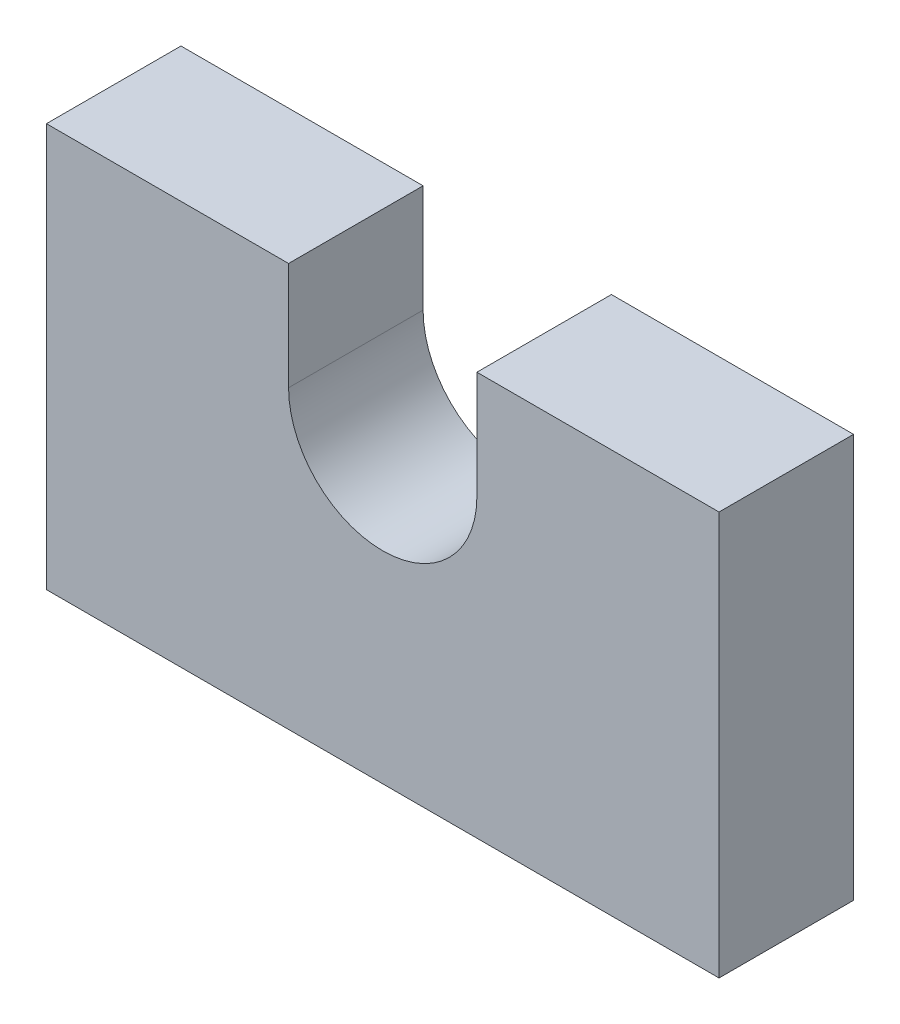
ISO-10303-21;
HEADER;
FILE_DESCRIPTION(('STEP AP214'),'2;1');
FILE_NAME('part.step','',(''),(''),'','','');
FILE_SCHEMA(('AUTOMOTIVE_DESIGN { 1 0 10303 214 1 1 1 1 }'));
ENDSEC;
DATA;
#1=APPLICATION_CONTEXT('core data for automotive mechanical design processes');
#2=APPLICATION_PROTOCOL_DEFINITION('international standard','automotive_design',2000,#1);
#3=PRODUCT_CONTEXT('',#1,'mechanical');
#4=PRODUCT('Part','Part','',(#3));
#5=PRODUCT_RELATED_PRODUCT_CATEGORY('part','',(#4));
#6=PRODUCT_DEFINITION_FORMATION('','',#4);
#7=PRODUCT_DEFINITION_CONTEXT('part definition',#1,'design');
#8=PRODUCT_DEFINITION('design','',#6,#7);
#9=PRODUCT_DEFINITION_SHAPE('','',#8);
#10=(LENGTH_UNIT() NAMED_UNIT(*) SI_UNIT(.MILLI.,.METRE.));
#11=(NAMED_UNIT(*) PLANE_ANGLE_UNIT() SI_UNIT($,.RADIAN.));
#12=(NAMED_UNIT(*) SI_UNIT($,.STERADIAN.) SOLID_ANGLE_UNIT());
#13=UNCERTAINTY_MEASURE_WITH_UNIT(LENGTH_MEASURE(1.E-05),#10,'distance_accuracy_value','');
#14=(GEOMETRIC_REPRESENTATION_CONTEXT(3) GLOBAL_UNCERTAINTY_ASSIGNED_CONTEXT((#13)) GLOBAL_UNIT_ASSIGNED_CONTEXT((#10,
#11,#12)) REPRESENTATION_CONTEXT('',''));
#15=CARTESIAN_POINT('',(0.,0.,0.));
#16=DIRECTION('',(0.,0.,1.));
#17=DIRECTION('',(1.,0.,0.));
#18=AXIS2_PLACEMENT_3D('',#15,#16,#17);
#19=CARTESIAN_POINT('',(-125.,0.,50.));
#20=DIRECTION('',(1.,0.,0.));
#21=DIRECTION('',(0.,0.,-1.));
#22=AXIS2_PLACEMENT_3D('',#19,#20,#21);
#23=PLANE('',#22);
#24=DIRECTION('',(0.,-1.,0.));
#25=VECTOR('',#24,1.);
#26=CARTESIAN_POINT('',(-125.,0.,0.));
#27=LINE('',#26,#25);
#28=CARTESIAN_POINT('',(-125.,150.,0.));
#29=VERTEX_POINT('',#28);
#30=CARTESIAN_POINT('',(-125.,0.,0.));
#31=VERTEX_POINT('',#30);
#32=EDGE_CURVE('E130',#29,#31,#27,.T.);
#33=ORIENTED_EDGE('',*,*,#32,.T.);
#34=DIRECTION('',(0.,0.,-1.));
#35=VECTOR('',#34,1.);
#36=CARTESIAN_POINT('',(-125.,0.,50.));
#37=LINE('',#36,#35);
#38=CARTESIAN_POINT('',(-125.,0.,50.));
#39=VERTEX_POINT('',#38);
#40=EDGE_CURVE('E11',#39,#31,#37,.T.);
#41=ORIENTED_EDGE('',*,*,#40,.F.);
#42=DIRECTION('',(0.,-1.,0.));
#43=VECTOR('',#42,1.);
#44=CARTESIAN_POINT('',(-125.,0.,50.));
#45=LINE('',#44,#43);
#46=CARTESIAN_POINT('',(-125.,150.,50.));
#47=VERTEX_POINT('',#46);
#48=EDGE_CURVE('E144',#47,#39,#45,.T.);
#49=ORIENTED_EDGE('',*,*,#48,.F.);
#50=DIRECTION('',(0.,0.,-1.));
#51=VECTOR('',#50,1.);
#52=CARTESIAN_POINT('',(-125.,150.,50.));
#53=LINE('',#52,#51);
#54=EDGE_CURVE('E126',#47,#29,#53,.T.);
#55=ORIENTED_EDGE('',*,*,#54,.T.);
#56=EDGE_LOOP('',(#33,#41,#49,#55));
#57=FACE_BOUND('',#56,.T.);
#58=ADVANCED_FACE('F34',(#57),#23,.F.);
#59=CARTESIAN_POINT('',(-125.,0.,50.));
#60=DIRECTION('',(0.,1.,0.));
#61=DIRECTION('',(0.,0.,1.));
#62=AXIS2_PLACEMENT_3D('',#59,#60,#61);
#63=PLANE('',#62);
#64=DIRECTION('',(1.,0.,0.));
#65=VECTOR('',#64,1.);
#66=CARTESIAN_POINT('',(-125.,0.,0.));
#67=LINE('',#66,#65);
#68=CARTESIAN_POINT('',(125.,0.,0.));
#69=VERTEX_POINT('',#68);
#70=EDGE_CURVE('E133',#31,#69,#67,.T.);
#71=ORIENTED_EDGE('',*,*,#70,.T.);
#72=DIRECTION('',(0.,0.,-1.));
#73=VECTOR('',#72,1.);
#74=CARTESIAN_POINT('',(125.,0.,50.));
#75=LINE('',#74,#73);
#76=CARTESIAN_POINT('',(125.,0.,50.));
#77=VERTEX_POINT('',#76);
#78=EDGE_CURVE('E42',#77,#69,#75,.T.);
#79=ORIENTED_EDGE('',*,*,#78,.F.);
#80=DIRECTION('',(1.,0.,0.));
#81=VECTOR('',#80,1.);
#82=CARTESIAN_POINT('',(-125.,0.,50.));
#83=LINE('',#82,#81);
#84=EDGE_CURVE('E93',#39,#77,#83,.T.);
#85=ORIENTED_EDGE('',*,*,#84,.F.);
#86=ORIENTED_EDGE('',*,*,#40,.T.);
#87=EDGE_LOOP('',(#71,#79,#85,#86));
#88=FACE_BOUND('',#87,.T.);
#89=ADVANCED_FACE('F179',(#88),#63,.F.);
#90=CARTESIAN_POINT('',(125.,0.,50.));
#91=DIRECTION('',(-1.,0.,0.));
#92=DIRECTION('',(0.,0.,1.));
#93=AXIS2_PLACEMENT_3D('',#90,#91,#92);
#94=PLANE('',#93);
#95=DIRECTION('',(0.,1.,0.));
#96=VECTOR('',#95,1.);
#97=CARTESIAN_POINT('',(125.,0.,0.));
#98=LINE('',#97,#96);
#99=CARTESIAN_POINT('',(125.,150.,0.));
#100=VERTEX_POINT('',#99);
#101=EDGE_CURVE('E135',#69,#100,#98,.T.);
#102=ORIENTED_EDGE('',*,*,#101,.T.);
#103=DIRECTION('',(0.,0.,-1.));
#104=VECTOR('',#103,1.);
#105=CARTESIAN_POINT('',(125.,150.,50.));
#106=LINE('',#105,#104);
#107=CARTESIAN_POINT('',(125.,150.,50.));
#108=VERTEX_POINT('',#107);
#109=EDGE_CURVE('E151',#108,#100,#106,.T.);
#110=ORIENTED_EDGE('',*,*,#109,.F.);
#111=DIRECTION('',(0.,1.,0.));
#112=VECTOR('',#111,1.);
#113=CARTESIAN_POINT('',(125.,0.,50.));
#114=LINE('',#113,#112);
#115=EDGE_CURVE('E159',#77,#108,#114,.T.);
#116=ORIENTED_EDGE('',*,*,#115,.F.);
#117=ORIENTED_EDGE('',*,*,#78,.T.);
#118=EDGE_LOOP('',(#102,#110,#116,#117));
#119=FACE_BOUND('',#118,.T.);
#120=ADVANCED_FACE('F157',(#119),#94,.F.);
#121=CARTESIAN_POINT('',(125.,150.,50.));
#122=DIRECTION('',(0.,-1.,0.));
#123=DIRECTION('',(0.,0.,-1.));
#124=AXIS2_PLACEMENT_3D('',#121,#122,#123);
#125=PLANE('',#124);
#126=DIRECTION('',(-1.,0.,0.));
#127=VECTOR('',#126,1.);
#128=CARTESIAN_POINT('',(125.,150.,0.));
#129=LINE('',#128,#127);
#130=CARTESIAN_POINT('',(35.,150.,0.));
#131=VERTEX_POINT('',#130);
#132=EDGE_CURVE('E137',#100,#131,#129,.T.);
#133=ORIENTED_EDGE('',*,*,#132,.T.);
#134=DIRECTION('',(0.,0.,-1.));
#135=VECTOR('',#134,1.);
#136=CARTESIAN_POINT('',(35.,150.,50.));
#137=LINE('',#136,#135);
#138=CARTESIAN_POINT('',(35.,150.,50.));
#139=VERTEX_POINT('',#138);
#140=EDGE_CURVE('E148',#139,#131,#137,.T.);
#141=ORIENTED_EDGE('',*,*,#140,.F.);
#142=DIRECTION('',(-1.,0.,0.));
#143=VECTOR('',#142,1.);
#144=CARTESIAN_POINT('',(125.,150.,50.));
#145=LINE('',#144,#143);
#146=EDGE_CURVE('E171',#108,#139,#145,.T.);
#147=ORIENTED_EDGE('',*,*,#146,.F.);
#148=ORIENTED_EDGE('',*,*,#109,.T.);
#149=EDGE_LOOP('',(#133,#141,#147,#148));
#150=FACE_BOUND('',#149,.T.);
#151=ADVANCED_FACE('F167',(#150),#125,.F.);
#152=CARTESIAN_POINT('',(35.,150.,50.));
#153=DIRECTION('',(1.,0.,0.));
#154=DIRECTION('',(0.,1.,0.));
#155=AXIS2_PLACEMENT_3D('',#152,#153,#154);
#156=PLANE('',#155);
#157=DIRECTION('',(0.,-1.,0.));
#158=VECTOR('',#157,1.);
#159=CARTESIAN_POINT('',(35.,150.,0.));
#160=LINE('',#159,#158);
#161=CARTESIAN_POINT('',(35.,110.,0.));
#162=VERTEX_POINT('',#161);
#163=EDGE_CURVE('E139',#131,#162,#160,.T.);
#164=ORIENTED_EDGE('',*,*,#163,.T.);
#165=DIRECTION('',(0.,0.,-1.));
#166=VECTOR('',#165,1.);
#167=CARTESIAN_POINT('',(35.,110.,50.));
#168=LINE('',#167,#166);
#169=CARTESIAN_POINT('',(35.,110.,50.));
#170=VERTEX_POINT('',#169);
#171=EDGE_CURVE('E121',#170,#162,#168,.T.);
#172=ORIENTED_EDGE('',*,*,#171,.F.);
#173=DIRECTION('',(0.,-1.,0.));
#174=VECTOR('',#173,1.);
#175=CARTESIAN_POINT('',(35.,150.,50.));
#176=LINE('',#175,#174);
#177=EDGE_CURVE('E112',#139,#170,#176,.T.);
#178=ORIENTED_EDGE('',*,*,#177,.F.);
#179=ORIENTED_EDGE('',*,*,#140,.T.);
#180=EDGE_LOOP('',(#164,#172,#178,#179));
#181=FACE_BOUND('',#180,.T.);
#182=ADVANCED_FACE('F170',(#181),#156,.F.);
#183=CARTESIAN_POINT('',(0.,110.,50.));
#184=DIRECTION('',(0.,0.,-1.));
#185=DIRECTION('',(-1.,0.,0.));
#186=AXIS2_PLACEMENT_3D('',#183,#184,#185);
#187=CYLINDRICAL_SURFACE('',#186,35.);
#188=CARTESIAN_POINT('',(0.,110.,0.));
#189=DIRECTION('',(0.,0.,-1.));
#190=DIRECTION('',(1.,0.,0.));
#191=AXIS2_PLACEMENT_3D('',#188,#189,#190);
#192=CIRCLE('',#191,35.);
#193=CARTESIAN_POINT('',(-35.,110.,0.));
#194=VERTEX_POINT('',#193);
#195=EDGE_CURVE('E120',#162,#194,#192,.T.);
#196=ORIENTED_EDGE('',*,*,#195,.T.);
#197=DIRECTION('',(0.,0.,-1.));
#198=VECTOR('',#197,1.);
#199=CARTESIAN_POINT('',(-35.,110.,50.));
#200=LINE('',#199,#198);
#201=CARTESIAN_POINT('',(-35.,110.,50.));
#202=VERTEX_POINT('',#201);
#203=EDGE_CURVE('E117',#202,#194,#200,.T.);
#204=ORIENTED_EDGE('',*,*,#203,.F.);
#205=CARTESIAN_POINT('',(0.,110.,50.));
#206=DIRECTION('',(0.,0.,-1.));
#207=DIRECTION('',(1.,0.,0.));
#208=AXIS2_PLACEMENT_3D('',#205,#206,#207);
#209=CIRCLE('',#208,35.);
#210=EDGE_CURVE('E106',#170,#202,#209,.T.);
#211=ORIENTED_EDGE('',*,*,#210,.F.);
#212=ORIENTED_EDGE('',*,*,#171,.T.);
#213=EDGE_LOOP('',(#196,#204,#211,#212));
#214=FACE_BOUND('',#213,.T.);
#215=ADVANCED_FACE('F118',(#214),#187,.F.);
#216=CARTESIAN_POINT('',(-35.,150.,50.));
#217=DIRECTION('',(-1.,0.,0.));
#218=DIRECTION('',(0.,0.,1.));
#219=AXIS2_PLACEMENT_3D('',#216,#217,#218);
#220=PLANE('',#219);
#221=DIRECTION('',(0.,1.,0.));
#222=VECTOR('',#221,1.);
#223=CARTESIAN_POINT('',(-35.,150.,0.));
#224=LINE('',#223,#222);
#225=CARTESIAN_POINT('',(-35.,150.,0.));
#226=VERTEX_POINT('',#225);
#227=EDGE_CURVE('E79',#194,#226,#224,.T.);
#228=ORIENTED_EDGE('',*,*,#227,.T.);
#229=DIRECTION('',(0.,0.,-1.));
#230=VECTOR('',#229,1.);
#231=CARTESIAN_POINT('',(-35.,150.,50.));
#232=LINE('',#231,#230);
#233=CARTESIAN_POINT('',(-35.,150.,50.));
#234=VERTEX_POINT('',#233);
#235=EDGE_CURVE('E122',#234,#226,#232,.T.);
#236=ORIENTED_EDGE('',*,*,#235,.F.);
#237=DIRECTION('',(0.,1.,0.));
#238=VECTOR('',#237,1.);
#239=CARTESIAN_POINT('',(-35.,150.,50.));
#240=LINE('',#239,#238);
#241=EDGE_CURVE('E110',#202,#234,#240,.T.);
#242=ORIENTED_EDGE('',*,*,#241,.F.);
#243=ORIENTED_EDGE('',*,*,#203,.T.);
#244=EDGE_LOOP('',(#228,#236,#242,#243));
#245=FACE_BOUND('',#244,.T.);
#246=ADVANCED_FACE('F124',(#245),#220,.F.);
#247=CARTESIAN_POINT('',(-125.,150.,50.));
#248=DIRECTION('',(0.,-1.,0.));
#249=DIRECTION('',(0.,0.,-1.));
#250=AXIS2_PLACEMENT_3D('',#247,#248,#249);
#251=PLANE('',#250);
#252=DIRECTION('',(-1.,0.,0.));
#253=VECTOR('',#252,1.);
#254=CARTESIAN_POINT('',(-125.,150.,0.));
#255=LINE('',#254,#253);
#256=EDGE_CURVE('E85',#226,#29,#255,.T.);
#257=ORIENTED_EDGE('',*,*,#256,.T.);
#258=ORIENTED_EDGE('',*,*,#54,.F.);
#259=DIRECTION('',(-1.,0.,0.));
#260=VECTOR('',#259,1.);
#261=CARTESIAN_POINT('',(-125.,150.,50.));
#262=LINE('',#261,#260);
#263=EDGE_CURVE('E50',#234,#47,#262,.T.);
#264=ORIENTED_EDGE('',*,*,#263,.F.);
#265=ORIENTED_EDGE('',*,*,#235,.T.);
#266=EDGE_LOOP('',(#257,#258,#264,#265));
#267=FACE_BOUND('',#266,.T.);
#268=ADVANCED_FACE('F195',(#267),#251,.F.);
#269=CARTESIAN_POINT('',(0.,110.,50.));
#270=DIRECTION('',(0.,0.,1.));
#271=DIRECTION('',(1.,0.,0.));
#272=AXIS2_PLACEMENT_3D('',#269,#270,#271);
#273=PLANE('',#272);
#274=ORIENTED_EDGE('',*,*,#48,.T.);
#275=ORIENTED_EDGE('',*,*,#84,.T.);
#276=ORIENTED_EDGE('',*,*,#115,.T.);
#277=ORIENTED_EDGE('',*,*,#146,.T.);
#278=ORIENTED_EDGE('',*,*,#177,.T.);
#279=ORIENTED_EDGE('',*,*,#210,.T.);
#280=ORIENTED_EDGE('',*,*,#241,.T.);
#281=ORIENTED_EDGE('',*,*,#263,.T.);
#282=EDGE_LOOP('',(#274,#275,#276,#277,#278,#279,#280,#281));
#283=FACE_BOUND('',#282,.T.);
#284=ADVANCED_FACE('F108',(#283),#273,.T.);
#285=CARTESIAN_POINT('',(0.,110.,0.));
#286=DIRECTION('',(0.,0.,1.));
#287=DIRECTION('',(1.,0.,0.));
#288=AXIS2_PLACEMENT_3D('',#285,#286,#287);
#289=PLANE('',#288);
#290=ORIENTED_EDGE('',*,*,#32,.F.);
#291=ORIENTED_EDGE('',*,*,#256,.F.);
#292=ORIENTED_EDGE('',*,*,#227,.F.);
#293=ORIENTED_EDGE('',*,*,#195,.F.);
#294=ORIENTED_EDGE('',*,*,#163,.F.);
#295=ORIENTED_EDGE('',*,*,#132,.F.);
#296=ORIENTED_EDGE('',*,*,#101,.F.);
#297=ORIENTED_EDGE('',*,*,#70,.F.);
#298=EDGE_LOOP('',(#290,#291,#292,#293,#294,#295,#296,#297));
#299=FACE_BOUND('',#298,.T.);
#300=ADVANCED_FACE('F163',(#299),#289,.F.);
#301=CLOSED_SHELL('',(#58,#89,#120,#151,#182,#215,#246,#268,#284,#300));
#302=MANIFOLD_SOLID_BREP('B2',#301);
#303=ADVANCED_BREP_SHAPE_REPRESENTATION('',(#18,#302),#14);
#304=SHAPE_DEFINITION_REPRESENTATION(#9,#303);
ENDSEC;
END-ISO-10303-21;
